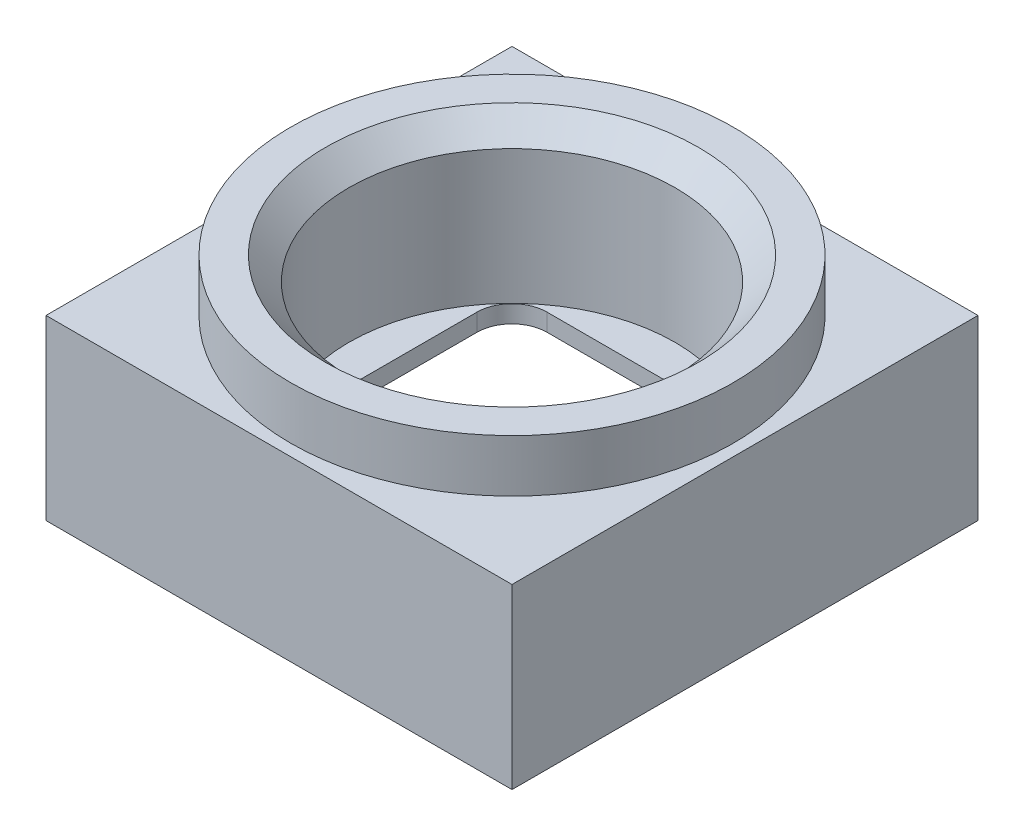
ISO-10303-21;
HEADER;
FILE_DESCRIPTION(('STEP AP214'),'2;1');
FILE_NAME('part.step','',(''),(''),'','','');
FILE_SCHEMA(('AUTOMOTIVE_DESIGN { 1 0 10303 214 1 1 1 1 }'));
ENDSEC;
DATA;
#1=APPLICATION_CONTEXT('core data for automotive mechanical design processes');
#2=APPLICATION_PROTOCOL_DEFINITION('international standard','automotive_design',2000,#1);
#3=PRODUCT_CONTEXT('',#1,'mechanical');
#4=PRODUCT('Part','Part','',(#3));
#5=PRODUCT_RELATED_PRODUCT_CATEGORY('part','',(#4));
#6=PRODUCT_DEFINITION_FORMATION('','',#4);
#7=PRODUCT_DEFINITION_CONTEXT('part definition',#1,'design');
#8=PRODUCT_DEFINITION('design','',#6,#7);
#9=PRODUCT_DEFINITION_SHAPE('','',#8);
#10=(LENGTH_UNIT() NAMED_UNIT(*) SI_UNIT(.MILLI.,.METRE.));
#11=(NAMED_UNIT(*) PLANE_ANGLE_UNIT() SI_UNIT($,.RADIAN.));
#12=(NAMED_UNIT(*) SI_UNIT($,.STERADIAN.) SOLID_ANGLE_UNIT());
#13=UNCERTAINTY_MEASURE_WITH_UNIT(LENGTH_MEASURE(1.E-05),#10,'distance_accuracy_value','');
#14=(GEOMETRIC_REPRESENTATION_CONTEXT(3) GLOBAL_UNCERTAINTY_ASSIGNED_CONTEXT((#13)) GLOBAL_UNIT_ASSIGNED_CONTEXT((#10,
#11,#12)) REPRESENTATION_CONTEXT('',''));
#15=CARTESIAN_POINT('',(0.,0.,0.));
#16=DIRECTION('',(0.,0.,1.));
#17=DIRECTION('',(1.,0.,0.));
#18=AXIS2_PLACEMENT_3D('',#15,#16,#17);
#19=CARTESIAN_POINT('',(0.,3.05,0.));
#20=DIRECTION('',(0.,1.,0.));
#21=DIRECTION('',(0.,0.,1.));
#22=AXIS2_PLACEMENT_3D('',#19,#20,#21);
#23=PLANE('',#22);
#24=DIRECTION('',(1.,0.,0.));
#25=VECTOR('',#24,1.);
#26=CARTESIAN_POINT('',(-4.00000000000003,3.05,3.99999999999998));
#27=LINE('',#26,#25);
#28=CARTESIAN_POINT('',(-4.00000000000003,3.05,3.99999999999998));
#29=VERTEX_POINT('',#28);
#30=CARTESIAN_POINT('',(3.99999999999998,3.05,3.99999999999995));
#31=VERTEX_POINT('',#30);
#32=EDGE_CURVE('E208',#29,#31,#27,.T.);
#33=ORIENTED_EDGE('',*,*,#32,.T.);
#34=DIRECTION('',(0.,0.,-1.));
#35=VECTOR('',#34,1.);
#36=CARTESIAN_POINT('',(3.99999999999998,3.05,3.99999999999995));
#37=LINE('',#36,#35);
#38=CARTESIAN_POINT('',(3.99999999999998,3.05,-4.00000000000003));
#39=VERTEX_POINT('',#38);
#40=EDGE_CURVE('E216',#31,#39,#37,.T.);
#41=ORIENTED_EDGE('',*,*,#40,.T.);
#42=DIRECTION('',(-1.,0.,0.));
#43=VECTOR('',#42,1.);
#44=CARTESIAN_POINT('',(3.99999999999998,3.05,-4.00000000000003));
#45=LINE('',#44,#43);
#46=CARTESIAN_POINT('',(-4.00000000000003,3.05,-4.00000000000003));
#47=VERTEX_POINT('',#46);
#48=EDGE_CURVE('E221',#39,#47,#45,.T.);
#49=ORIENTED_EDGE('',*,*,#48,.T.);
#50=DIRECTION('',(0.,0.,1.));
#51=VECTOR('',#50,1.);
#52=CARTESIAN_POINT('',(-4.00000000000003,3.05,-4.00000000000003));
#53=LINE('',#52,#51);
#54=EDGE_CURVE('E226',#47,#29,#53,.T.);
#55=ORIENTED_EDGE('',*,*,#54,.T.);
#56=EDGE_LOOP('',(#33,#41,#49,#55));
#57=FACE_BOUND('',#56,.T.);
#58=CARTESIAN_POINT('',(0.,3.05,0.));
#59=DIRECTION('',(0.,1.,0.));
#60=DIRECTION('',(0.,0.,1.));
#61=AXIS2_PLACEMENT_3D('',#58,#59,#60);
#62=CIRCLE('',#61,3.8);
#63=CARTESIAN_POINT('',(0.,3.05,3.8));
#64=VERTEX_POINT('',#63);
#65=EDGE_CURVE('E230',#64,#64,#62,.T.);
#66=ORIENTED_EDGE('',*,*,#65,.F.);
#67=EDGE_LOOP('',(#66));
#68=FACE_BOUND('',#67,.T.);
#69=ADVANCED_FACE('F39',(#57,#68),#23,.T.);
#70=CARTESIAN_POINT('',(0.,0.,0.));
#71=DIRECTION('',(0.,1.,0.));
#72=DIRECTION('',(0.,0.,1.));
#73=AXIS2_PLACEMENT_3D('',#70,#71,#72);
#74=PLANE('',#73);
#75=DIRECTION('',(0.,0.,1.));
#76=VECTOR('',#75,1.);
#77=CARTESIAN_POINT('',(-4.00000000000003,0.,-4.00000000000003));
#78=LINE('',#77,#76);
#79=CARTESIAN_POINT('',(-4.00000000000003,0.,-4.00000000000003));
#80=VERTEX_POINT('',#79);
#81=CARTESIAN_POINT('',(-4.00000000000003,0.,3.99999999999998));
#82=VERTEX_POINT('',#81);
#83=EDGE_CURVE('E391',#80,#82,#78,.T.);
#84=ORIENTED_EDGE('',*,*,#83,.F.);
#85=DIRECTION('',(-1.,0.,0.));
#86=VECTOR('',#85,1.);
#87=CARTESIAN_POINT('',(-4.00000000000003,0.,-4.00000000000003));
#88=LINE('',#87,#86);
#89=CARTESIAN_POINT('',(3.99999999999998,0.,-4.00000000000003));
#90=VERTEX_POINT('',#89);
#91=EDGE_CURVE('E62',#90,#80,#88,.T.);
#92=ORIENTED_EDGE('',*,*,#91,.F.);
#93=DIRECTION('',(0.,0.,-1.));
#94=VECTOR('',#93,1.);
#95=CARTESIAN_POINT('',(3.99999999999998,0.,-4.00000000000003));
#96=LINE('',#95,#94);
#97=CARTESIAN_POINT('',(3.99999999999998,0.,3.99999999999995));
#98=VERTEX_POINT('',#97);
#99=EDGE_CURVE('E395',#98,#90,#96,.T.);
#100=ORIENTED_EDGE('',*,*,#99,.F.);
#101=DIRECTION('',(1.,0.,0.));
#102=VECTOR('',#101,1.);
#103=CARTESIAN_POINT('',(-4.00000000000003,0.,3.99999999999998));
#104=LINE('',#103,#102);
#105=EDGE_CURVE('E209',#82,#98,#104,.T.);
#106=ORIENTED_EDGE('',*,*,#105,.F.);
#107=EDGE_LOOP('',(#84,#92,#100,#106));
#108=FACE_BOUND('',#107,.T.);
#109=DIRECTION('',(0.,0.,1.));
#110=VECTOR('',#109,1.);
#111=CARTESIAN_POINT('',(-3.70000000000003,0.,-3.70000000000003));
#112=LINE('',#111,#110);
#113=CARTESIAN_POINT('',(-3.70000000000003,0.,-3.70000000000003));
#114=VERTEX_POINT('',#113);
#115=CARTESIAN_POINT('',(-3.70000000000003,0.,3.69999999999998));
#116=VERTEX_POINT('',#115);
#117=EDGE_CURVE('E54',#114,#116,#112,.T.);
#118=ORIENTED_EDGE('',*,*,#117,.T.);
#119=DIRECTION('',(1.,0.,0.));
#120=VECTOR('',#119,1.);
#121=CARTESIAN_POINT('',(-3.70000000000003,0.,3.69999999999998));
#122=LINE('',#121,#120);
#123=CARTESIAN_POINT('',(3.69999999999998,0.,3.69999999999998));
#124=VERTEX_POINT('',#123);
#125=EDGE_CURVE('E376',#116,#124,#122,.T.);
#126=ORIENTED_EDGE('',*,*,#125,.T.);
#127=DIRECTION('',(0.,0.,-1.));
#128=VECTOR('',#127,1.);
#129=CARTESIAN_POINT('',(3.69999999999998,0.,-3.70000000000003));
#130=LINE('',#129,#128);
#131=CARTESIAN_POINT('',(3.69999999999998,0.,-3.70000000000003));
#132=VERTEX_POINT('',#131);
#133=EDGE_CURVE('E379',#124,#132,#130,.T.);
#134=ORIENTED_EDGE('',*,*,#133,.T.);
#135=DIRECTION('',(-1.,0.,0.));
#136=VECTOR('',#135,1.);
#137=CARTESIAN_POINT('',(-3.70000000000003,0.,-3.70000000000003));
#138=LINE('',#137,#136);
#139=EDGE_CURVE('E365',#132,#114,#138,.T.);
#140=ORIENTED_EDGE('',*,*,#139,.T.);
#141=EDGE_LOOP('',(#118,#126,#134,#140));
#142=FACE_BOUND('',#141,.T.);
#143=ADVANCED_FACE('F421',(#108,#142),#74,.F.);
#144=CARTESIAN_POINT('',(-4.00000000000003,0.6,-4.00000000000003));
#145=DIRECTION('',(1.,0.,0.));
#146=DIRECTION('',(0.,0.,-1.));
#147=AXIS2_PLACEMENT_3D('',#144,#145,#146);
#148=PLANE('',#147);
#149=ORIENTED_EDGE('',*,*,#83,.T.);
#150=DIRECTION('',(0.,-1.,0.));
#151=VECTOR('',#150,1.);
#152=CARTESIAN_POINT('',(-4.00000000000003,0.6,3.99999999999998));
#153=LINE('',#152,#151);
#154=EDGE_CURVE('E212',#29,#82,#153,.T.);
#155=ORIENTED_EDGE('',*,*,#154,.F.);
#156=ORIENTED_EDGE('',*,*,#54,.F.);
#157=DIRECTION('',(0.,-1.,0.));
#158=VECTOR('',#157,1.);
#159=CARTESIAN_POINT('',(-4.00000000000003,0.6,-4.00000000000003));
#160=LINE('',#159,#158);
#161=EDGE_CURVE('E398',#47,#80,#160,.T.);
#162=ORIENTED_EDGE('',*,*,#161,.T.);
#163=EDGE_LOOP('',(#149,#155,#156,#162));
#164=FACE_BOUND('',#163,.T.);
#165=ADVANCED_FACE('F426',(#164),#148,.F.);
#166=CARTESIAN_POINT('',(-4.00000000000003,0.6,3.99999999999998));
#167=DIRECTION('',(0.,0.,-1.));
#168=DIRECTION('',(-1.,0.,0.));
#169=AXIS2_PLACEMENT_3D('',#166,#167,#168);
#170=PLANE('',#169);
#171=ORIENTED_EDGE('',*,*,#105,.T.);
#172=DIRECTION('',(0.,-1.,0.));
#173=VECTOR('',#172,1.);
#174=CARTESIAN_POINT('',(3.99999999999998,0.6,3.99999999999995));
#175=LINE('',#174,#173);
#176=EDGE_CURVE('E203',#31,#98,#175,.T.);
#177=ORIENTED_EDGE('',*,*,#176,.F.);
#178=ORIENTED_EDGE('',*,*,#32,.F.);
#179=ORIENTED_EDGE('',*,*,#154,.T.);
#180=EDGE_LOOP('',(#171,#177,#178,#179));
#181=FACE_BOUND('',#180,.T.);
#182=ADVANCED_FACE('F205',(#181),#170,.F.);
#183=CARTESIAN_POINT('',(3.99999999999998,0.6,-4.00000000000003));
#184=DIRECTION('',(-1.,0.,0.));
#185=DIRECTION('',(0.,0.,1.));
#186=AXIS2_PLACEMENT_3D('',#183,#184,#185);
#187=PLANE('',#186);
#188=ORIENTED_EDGE('',*,*,#99,.T.);
#189=DIRECTION('',(0.,-1.,0.));
#190=VECTOR('',#189,1.);
#191=CARTESIAN_POINT('',(3.99999999999998,0.6,-4.00000000000003));
#192=LINE('',#191,#190);
#193=EDGE_CURVE('E213',#39,#90,#192,.T.);
#194=ORIENTED_EDGE('',*,*,#193,.F.);
#195=ORIENTED_EDGE('',*,*,#40,.F.);
#196=ORIENTED_EDGE('',*,*,#176,.T.);
#197=EDGE_LOOP('',(#188,#194,#195,#196));
#198=FACE_BOUND('',#197,.T.);
#199=ADVANCED_FACE('F217',(#198),#187,.F.);
#200=CARTESIAN_POINT('',(-4.00000000000003,0.6,-4.00000000000003));
#201=DIRECTION('',(0.,0.,1.));
#202=DIRECTION('',(1.,0.,0.));
#203=AXIS2_PLACEMENT_3D('',#200,#201,#202);
#204=PLANE('',#203);
#205=ORIENTED_EDGE('',*,*,#91,.T.);
#206=ORIENTED_EDGE('',*,*,#161,.F.);
#207=ORIENTED_EDGE('',*,*,#48,.F.);
#208=ORIENTED_EDGE('',*,*,#193,.T.);
#209=EDGE_LOOP('',(#205,#206,#207,#208));
#210=FACE_BOUND('',#209,.T.);
#211=ADVANCED_FACE('F521',(#210),#204,.F.);
#212=CARTESIAN_POINT('',(-3.70000000000003,0.6,-3.70000000000003));
#213=DIRECTION('',(1.,0.,0.));
#214=DIRECTION('',(0.,0.,-1.));
#215=AXIS2_PLACEMENT_3D('',#212,#213,#214);
#216=PLANE('',#215);
#217=ORIENTED_EDGE('',*,*,#117,.F.);
#218=DIRECTION('',(0.,-1.,0.));
#219=VECTOR('',#218,1.);
#220=CARTESIAN_POINT('',(-3.70000000000003,0.6,-3.70000000000003));
#221=LINE('',#220,#219);
#222=CARTESIAN_POINT('',(-3.70000000000003,0.6,-3.70000000000003));
#223=VERTEX_POINT('',#222);
#224=EDGE_CURVE('E374',#223,#114,#221,.T.);
#225=ORIENTED_EDGE('',*,*,#224,.F.);
#226=DIRECTION('',(0.,0.,1.));
#227=VECTOR('',#226,1.);
#228=CARTESIAN_POINT('',(-3.70000000000003,0.6,-3.70000000000003));
#229=LINE('',#228,#227);
#230=CARTESIAN_POINT('',(-3.70000000000003,0.6,3.69999999999998));
#231=VERTEX_POINT('',#230);
#232=EDGE_CURVE('E361',#223,#231,#229,.T.);
#233=ORIENTED_EDGE('',*,*,#232,.T.);
#234=DIRECTION('',(0.,-1.,0.));
#235=VECTOR('',#234,1.);
#236=CARTESIAN_POINT('',(-3.70000000000003,0.6,3.69999999999998));
#237=LINE('',#236,#235);
#238=EDGE_CURVE('E389',#231,#116,#237,.T.);
#239=ORIENTED_EDGE('',*,*,#238,.T.);
#240=EDGE_LOOP('',(#217,#225,#233,#239));
#241=FACE_BOUND('',#240,.T.);
#242=ADVANCED_FACE('F518',(#241),#216,.T.);
#243=CARTESIAN_POINT('',(-3.70000000000003,0.6,3.69999999999998));
#244=DIRECTION('',(0.,0.,-1.));
#245=DIRECTION('',(-1.,0.,0.));
#246=AXIS2_PLACEMENT_3D('',#243,#244,#245);
#247=PLANE('',#246);
#248=ORIENTED_EDGE('',*,*,#125,.F.);
#249=ORIENTED_EDGE('',*,*,#238,.F.);
#250=DIRECTION('',(1.,0.,0.));
#251=VECTOR('',#250,1.);
#252=CARTESIAN_POINT('',(-3.70000000000003,0.6,3.69999999999998));
#253=LINE('',#252,#251);
#254=CARTESIAN_POINT('',(3.69999999999998,0.6,3.69999999999998));
#255=VERTEX_POINT('',#254);
#256=EDGE_CURVE('E364',#231,#255,#253,.T.);
#257=ORIENTED_EDGE('',*,*,#256,.T.);
#258=DIRECTION('',(0.,-1.,0.));
#259=VECTOR('',#258,1.);
#260=CARTESIAN_POINT('',(3.69999999999998,0.6,3.69999999999998));
#261=LINE('',#260,#259);
#262=EDGE_CURVE('E387',#255,#124,#261,.T.);
#263=ORIENTED_EDGE('',*,*,#262,.T.);
#264=EDGE_LOOP('',(#248,#249,#257,#263));
#265=FACE_BOUND('',#264,.T.);
#266=ADVANCED_FACE('F514',(#265),#247,.T.);
#267=CARTESIAN_POINT('',(3.69999999999998,0.6,-3.70000000000003));
#268=DIRECTION('',(-1.,0.,0.));
#269=DIRECTION('',(0.,0.,1.));
#270=AXIS2_PLACEMENT_3D('',#267,#268,#269);
#271=PLANE('',#270);
#272=ORIENTED_EDGE('',*,*,#133,.F.);
#273=ORIENTED_EDGE('',*,*,#262,.F.);
#274=DIRECTION('',(0.,0.,-1.));
#275=VECTOR('',#274,1.);
#276=CARTESIAN_POINT('',(3.69999999999998,0.6,-3.70000000000003));
#277=LINE('',#276,#275);
#278=CARTESIAN_POINT('',(3.69999999999998,0.6,-3.70000000000003));
#279=VERTEX_POINT('',#278);
#280=EDGE_CURVE('E368',#255,#279,#277,.T.);
#281=ORIENTED_EDGE('',*,*,#280,.T.);
#282=DIRECTION('',(0.,-1.,0.));
#283=VECTOR('',#282,1.);
#284=CARTESIAN_POINT('',(3.69999999999998,0.6,-3.70000000000003));
#285=LINE('',#284,#283);
#286=EDGE_CURVE('E385',#279,#132,#285,.T.);
#287=ORIENTED_EDGE('',*,*,#286,.T.);
#288=EDGE_LOOP('',(#272,#273,#281,#287));
#289=FACE_BOUND('',#288,.T.);
#290=ADVANCED_FACE('F510',(#289),#271,.T.);
#291=CARTESIAN_POINT('',(-3.70000000000003,0.6,-3.70000000000003));
#292=DIRECTION('',(0.,0.,1.));
#293=DIRECTION('',(1.,0.,0.));
#294=AXIS2_PLACEMENT_3D('',#291,#292,#293);
#295=PLANE('',#294);
#296=ORIENTED_EDGE('',*,*,#139,.F.);
#297=ORIENTED_EDGE('',*,*,#286,.F.);
#298=DIRECTION('',(-1.,0.,0.));
#299=VECTOR('',#298,1.);
#300=CARTESIAN_POINT('',(-3.70000000000003,0.6,-3.70000000000003));
#301=LINE('',#300,#299);
#302=EDGE_CURVE('E371',#279,#223,#301,.T.);
#303=ORIENTED_EDGE('',*,*,#302,.T.);
#304=ORIENTED_EDGE('',*,*,#224,.T.);
#305=EDGE_LOOP('',(#296,#297,#303,#304));
#306=FACE_BOUND('',#305,.T.);
#307=ADVANCED_FACE('F506',(#306),#295,.T.);
#308=CARTESIAN_POINT('',(0.,0.6,0.));
#309=DIRECTION('',(0.,1.,0.));
#310=DIRECTION('',(0.,0.,1.));
#311=AXIS2_PLACEMENT_3D('',#308,#309,#310);
#312=PLANE('',#311);
#313=ORIENTED_EDGE('',*,*,#232,.F.);
#314=ORIENTED_EDGE('',*,*,#302,.F.);
#315=ORIENTED_EDGE('',*,*,#280,.F.);
#316=ORIENTED_EDGE('',*,*,#256,.F.);
#317=EDGE_LOOP('',(#313,#314,#315,#316));
#318=FACE_BOUND('',#317,.T.);
#319=CARTESIAN_POINT('',(3.1,0.6,-3.1));
#320=DIRECTION('',(0.,1.,0.));
#321=DIRECTION('',(0.,0.,1.));
#322=AXIS2_PLACEMENT_3D('',#319,#320,#321);
#323=CIRCLE('',#322,0.35);
#324=CARTESIAN_POINT('',(3.2,0.6,-2.76458980337503));
#325=VERTEX_POINT('',#324);
#326=CARTESIAN_POINT('',(2.76458980337503,0.6,-3.2));
#327=VERTEX_POINT('',#326);
#328=EDGE_CURVE('E295',#325,#327,#323,.T.);
#329=ORIENTED_EDGE('',*,*,#328,.T.);
#330=DIRECTION('',(-1.,0.,0.));
#331=VECTOR('',#330,1.);
#332=CARTESIAN_POINT('',(-2.76458980337503,0.6,-3.2));
#333=LINE('',#332,#331);
#334=CARTESIAN_POINT('',(-2.76458980337503,0.6,-3.2));
#335=VERTEX_POINT('',#334);
#336=EDGE_CURVE('E324',#327,#335,#333,.T.);
#337=ORIENTED_EDGE('',*,*,#336,.T.);
#338=CARTESIAN_POINT('',(-3.1,0.6,-3.1));
#339=DIRECTION('',(0.,1.,0.));
#340=DIRECTION('',(0.,0.,-1.));
#341=AXIS2_PLACEMENT_3D('',#338,#339,#340);
#342=CIRCLE('',#341,0.35);
#343=CARTESIAN_POINT('',(-3.2,0.6,-2.76458980337503));
#344=VERTEX_POINT('',#343);
#345=EDGE_CURVE('E327',#335,#344,#342,.T.);
#346=ORIENTED_EDGE('',*,*,#345,.T.);
#347=DIRECTION('',(0.,0.,1.));
#348=VECTOR('',#347,1.);
#349=CARTESIAN_POINT('',(-3.2,0.6,-2.76458980337503));
#350=LINE('',#349,#348);
#351=CARTESIAN_POINT('',(-3.2,0.6,2.76458980337503));
#352=VERTEX_POINT('',#351);
#353=EDGE_CURVE('E330',#344,#352,#350,.T.);
#354=ORIENTED_EDGE('',*,*,#353,.T.);
#355=CARTESIAN_POINT('',(-3.1,0.6,3.1));
#356=DIRECTION('',(0.,1.,0.));
#357=DIRECTION('',(0.,0.,1.));
#358=AXIS2_PLACEMENT_3D('',#355,#356,#357);
#359=CIRCLE('',#358,0.35);
#360=CARTESIAN_POINT('',(-2.76458980337503,0.6,3.2));
#361=VERTEX_POINT('',#360);
#362=EDGE_CURVE('E333',#352,#361,#359,.T.);
#363=ORIENTED_EDGE('',*,*,#362,.T.);
#364=DIRECTION('',(1.,0.,0.));
#365=VECTOR('',#364,1.);
#366=CARTESIAN_POINT('',(-2.76458980337503,0.6,3.2));
#367=LINE('',#366,#365);
#368=CARTESIAN_POINT('',(2.76458980337503,0.6,3.2));
#369=VERTEX_POINT('',#368);
#370=EDGE_CURVE('E336',#361,#369,#367,.T.);
#371=ORIENTED_EDGE('',*,*,#370,.T.);
#372=CARTESIAN_POINT('',(3.1,0.6,3.1));
#373=DIRECTION('',(0.,1.,0.));
#374=DIRECTION('',(0.,0.,-1.));
#375=AXIS2_PLACEMENT_3D('',#372,#373,#374);
#376=CIRCLE('',#375,0.35);
#377=CARTESIAN_POINT('',(3.2,0.6,2.76458980337503));
#378=VERTEX_POINT('',#377);
#379=EDGE_CURVE('E339',#369,#378,#376,.T.);
#380=ORIENTED_EDGE('',*,*,#379,.T.);
#381=DIRECTION('',(0.,0.,-1.));
#382=VECTOR('',#381,1.);
#383=CARTESIAN_POINT('',(3.2,0.6,-2.76458980337503));
#384=LINE('',#383,#382);
#385=EDGE_CURVE('E300',#378,#325,#384,.T.);
#386=ORIENTED_EDGE('',*,*,#385,.T.);
#387=EDGE_LOOP('',(#329,#337,#346,#354,#363,#371,#380,#386));
#388=FACE_BOUND('',#387,.T.);
#389=ADVANCED_FACE('F502',(#318,#388),#312,.F.);
#390=CARTESIAN_POINT('',(3.1,0.95,-3.1));
#391=DIRECTION('',(0.,-1.,0.));
#392=DIRECTION('',(0.,0.,-1.));
#393=AXIS2_PLACEMENT_3D('',#390,#391,#392);
#394=CYLINDRICAL_SURFACE('',#393,0.35);
#395=ORIENTED_EDGE('',*,*,#328,.F.);
#396=DIRECTION('',(0.,-1.,0.));
#397=VECTOR('',#396,1.);
#398=CARTESIAN_POINT('',(3.2,0.95,-2.76458980337503));
#399=LINE('',#398,#397);
#400=CARTESIAN_POINT('',(3.2,0.95,-2.76458980337503));
#401=VERTEX_POINT('',#400);
#402=EDGE_CURVE('E321',#401,#325,#399,.T.);
#403=ORIENTED_EDGE('',*,*,#402,.F.);
#404=CARTESIAN_POINT('',(3.1,0.95,-3.1));
#405=DIRECTION('',(0.,1.,0.));
#406=DIRECTION('',(0.,0.,1.));
#407=AXIS2_PLACEMENT_3D('',#404,#405,#406);
#408=CIRCLE('',#407,0.35);
#409=CARTESIAN_POINT('',(2.76458980337503,0.95,-3.2));
#410=VERTEX_POINT('',#409);
#411=EDGE_CURVE('E296',#401,#410,#408,.T.);
#412=ORIENTED_EDGE('',*,*,#411,.T.);
#413=DIRECTION('',(0.,-1.,0.));
#414=VECTOR('',#413,1.);
#415=CARTESIAN_POINT('',(2.76458980337503,0.95,-3.2));
#416=LINE('',#415,#414);
#417=EDGE_CURVE('E358',#410,#327,#416,.T.);
#418=ORIENTED_EDGE('',*,*,#417,.T.);
#419=EDGE_LOOP('',(#395,#403,#412,#418));
#420=FACE_BOUND('',#419,.T.);
#421=ADVANCED_FACE('F498',(#420),#394,.F.);
#422=CARTESIAN_POINT('',(-2.76458980337503,0.95,-3.2));
#423=DIRECTION('',(0.,0.,1.));
#424=DIRECTION('',(1.,0.,0.));
#425=AXIS2_PLACEMENT_3D('',#422,#423,#424);
#426=PLANE('',#425);
#427=ORIENTED_EDGE('',*,*,#336,.F.);
#428=ORIENTED_EDGE('',*,*,#417,.F.);
#429=DIRECTION('',(-1.,0.,0.));
#430=VECTOR('',#429,1.);
#431=CARTESIAN_POINT('',(-2.76458980337503,0.95,-3.2));
#432=LINE('',#431,#430);
#433=CARTESIAN_POINT('',(-2.76458980337503,0.95,-3.2));
#434=VERTEX_POINT('',#433);
#435=EDGE_CURVE('E299',#410,#434,#432,.T.);
#436=ORIENTED_EDGE('',*,*,#435,.T.);
#437=DIRECTION('',(0.,-1.,0.));
#438=VECTOR('',#437,1.);
#439=CARTESIAN_POINT('',(-2.76458980337503,0.95,-3.2));
#440=LINE('',#439,#438);
#441=EDGE_CURVE('E356',#434,#335,#440,.T.);
#442=ORIENTED_EDGE('',*,*,#441,.T.);
#443=EDGE_LOOP('',(#427,#428,#436,#442));
#444=FACE_BOUND('',#443,.T.);
#445=ADVANCED_FACE('F494',(#444),#426,.T.);
#446=CARTESIAN_POINT('',(-3.1,0.95,-3.1));
#447=DIRECTION('',(0.,-1.,0.));
#448=DIRECTION('',(0.,0.,-1.));
#449=AXIS2_PLACEMENT_3D('',#446,#447,#448);
#450=CYLINDRICAL_SURFACE('',#449,0.35);
#451=ORIENTED_EDGE('',*,*,#345,.F.);
#452=ORIENTED_EDGE('',*,*,#441,.F.);
#453=CARTESIAN_POINT('',(-3.1,0.95,-3.1));
#454=DIRECTION('',(0.,1.,0.));
#455=DIRECTION('',(0.,0.,-1.));
#456=AXIS2_PLACEMENT_3D('',#453,#454,#455);
#457=CIRCLE('',#456,0.35);
#458=CARTESIAN_POINT('',(-3.2,0.95,-2.76458980337503));
#459=VERTEX_POINT('',#458);
#460=EDGE_CURVE('E303',#434,#459,#457,.T.);
#461=ORIENTED_EDGE('',*,*,#460,.T.);
#462=DIRECTION('',(0.,-1.,0.));
#463=VECTOR('',#462,1.);
#464=CARTESIAN_POINT('',(-3.2,0.95,-2.76458980337503));
#465=LINE('',#464,#463);
#466=EDGE_CURVE('E354',#459,#344,#465,.T.);
#467=ORIENTED_EDGE('',*,*,#466,.T.);
#468=EDGE_LOOP('',(#451,#452,#461,#467));
#469=FACE_BOUND('',#468,.T.);
#470=ADVANCED_FACE('F490',(#469),#450,.F.);
#471=CARTESIAN_POINT('',(-3.2,0.95,-2.76458980337503));
#472=DIRECTION('',(1.,0.,0.));
#473=DIRECTION('',(0.,0.,-1.));
#474=AXIS2_PLACEMENT_3D('',#471,#472,#473);
#475=PLANE('',#474);
#476=ORIENTED_EDGE('',*,*,#353,.F.);
#477=ORIENTED_EDGE('',*,*,#466,.F.);
#478=DIRECTION('',(0.,0.,1.));
#479=VECTOR('',#478,1.);
#480=CARTESIAN_POINT('',(-3.2,0.95,-2.76458980337503));
#481=LINE('',#480,#479);
#482=CARTESIAN_POINT('',(-3.2,0.95,2.76458980337503));
#483=VERTEX_POINT('',#482);
#484=EDGE_CURVE('E306',#459,#483,#481,.T.);
#485=ORIENTED_EDGE('',*,*,#484,.T.);
#486=DIRECTION('',(0.,-1.,0.));
#487=VECTOR('',#486,1.);
#488=CARTESIAN_POINT('',(-3.2,0.95,2.76458980337503));
#489=LINE('',#488,#487);
#490=EDGE_CURVE('E352',#483,#352,#489,.T.);
#491=ORIENTED_EDGE('',*,*,#490,.T.);
#492=EDGE_LOOP('',(#476,#477,#485,#491));
#493=FACE_BOUND('',#492,.T.);
#494=ADVANCED_FACE('F486',(#493),#475,.T.);
#495=CARTESIAN_POINT('',(-3.1,0.95,3.1));
#496=DIRECTION('',(0.,-1.,0.));
#497=DIRECTION('',(0.,0.,-1.));
#498=AXIS2_PLACEMENT_3D('',#495,#496,#497);
#499=CYLINDRICAL_SURFACE('',#498,0.35);
#500=ORIENTED_EDGE('',*,*,#362,.F.);
#501=ORIENTED_EDGE('',*,*,#490,.F.);
#502=CARTESIAN_POINT('',(-3.1,0.95,3.1));
#503=DIRECTION('',(0.,1.,0.));
#504=DIRECTION('',(0.,0.,1.));
#505=AXIS2_PLACEMENT_3D('',#502,#503,#504);
#506=CIRCLE('',#505,0.35);
#507=CARTESIAN_POINT('',(-2.76458980337503,0.95,3.2));
#508=VERTEX_POINT('',#507);
#509=EDGE_CURVE('E309',#483,#508,#506,.T.);
#510=ORIENTED_EDGE('',*,*,#509,.T.);
#511=DIRECTION('',(0.,-1.,0.));
#512=VECTOR('',#511,1.);
#513=CARTESIAN_POINT('',(-2.76458980337503,0.95,3.2));
#514=LINE('',#513,#512);
#515=EDGE_CURVE('E350',#508,#361,#514,.T.);
#516=ORIENTED_EDGE('',*,*,#515,.T.);
#517=EDGE_LOOP('',(#500,#501,#510,#516));
#518=FACE_BOUND('',#517,.T.);
#519=ADVANCED_FACE('F482',(#518),#499,.F.);
#520=CARTESIAN_POINT('',(-2.76458980337503,0.95,3.2));
#521=DIRECTION('',(0.,0.,-1.));
#522=DIRECTION('',(-1.,0.,0.));
#523=AXIS2_PLACEMENT_3D('',#520,#521,#522);
#524=PLANE('',#523);
#525=ORIENTED_EDGE('',*,*,#370,.F.);
#526=ORIENTED_EDGE('',*,*,#515,.F.);
#527=DIRECTION('',(1.,0.,0.));
#528=VECTOR('',#527,1.);
#529=CARTESIAN_POINT('',(-2.76458980337503,0.95,3.2));
#530=LINE('',#529,#528);
#531=CARTESIAN_POINT('',(2.76458980337503,0.95,3.2));
#532=VERTEX_POINT('',#531);
#533=EDGE_CURVE('E312',#508,#532,#530,.T.);
#534=ORIENTED_EDGE('',*,*,#533,.T.);
#535=DIRECTION('',(0.,-1.,0.));
#536=VECTOR('',#535,1.);
#537=CARTESIAN_POINT('',(2.76458980337503,0.95,3.2));
#538=LINE('',#537,#536);
#539=EDGE_CURVE('E348',#532,#369,#538,.T.);
#540=ORIENTED_EDGE('',*,*,#539,.T.);
#541=EDGE_LOOP('',(#525,#526,#534,#540));
#542=FACE_BOUND('',#541,.T.);
#543=ADVANCED_FACE('F478',(#542),#524,.T.);
#544=CARTESIAN_POINT('',(3.1,0.95,3.1));
#545=DIRECTION('',(0.,-1.,0.));
#546=DIRECTION('',(0.,0.,-1.));
#547=AXIS2_PLACEMENT_3D('',#544,#545,#546);
#548=CYLINDRICAL_SURFACE('',#547,0.35);
#549=ORIENTED_EDGE('',*,*,#379,.F.);
#550=ORIENTED_EDGE('',*,*,#539,.F.);
#551=CARTESIAN_POINT('',(3.1,0.95,3.1));
#552=DIRECTION('',(0.,1.,0.));
#553=DIRECTION('',(0.,0.,-1.));
#554=AXIS2_PLACEMENT_3D('',#551,#552,#553);
#555=CIRCLE('',#554,0.35);
#556=CARTESIAN_POINT('',(3.2,0.95,2.76458980337503));
#557=VERTEX_POINT('',#556);
#558=EDGE_CURVE('E315',#532,#557,#555,.T.);
#559=ORIENTED_EDGE('',*,*,#558,.T.);
#560=DIRECTION('',(0.,-1.,0.));
#561=VECTOR('',#560,1.);
#562=CARTESIAN_POINT('',(3.2,0.95,2.76458980337503));
#563=LINE('',#562,#561);
#564=EDGE_CURVE('E346',#557,#378,#563,.T.);
#565=ORIENTED_EDGE('',*,*,#564,.T.);
#566=EDGE_LOOP('',(#549,#550,#559,#565));
#567=FACE_BOUND('',#566,.T.);
#568=ADVANCED_FACE('F474',(#567),#548,.F.);
#569=CARTESIAN_POINT('',(3.2,0.95,-2.76458980337503));
#570=DIRECTION('',(-1.,0.,0.));
#571=DIRECTION('',(0.,0.,1.));
#572=AXIS2_PLACEMENT_3D('',#569,#570,#571);
#573=PLANE('',#572);
#574=ORIENTED_EDGE('',*,*,#385,.F.);
#575=ORIENTED_EDGE('',*,*,#564,.F.);
#576=DIRECTION('',(0.,0.,-1.));
#577=VECTOR('',#576,1.);
#578=CARTESIAN_POINT('',(3.2,0.95,-2.76458980337503));
#579=LINE('',#578,#577);
#580=EDGE_CURVE('E318',#557,#401,#579,.T.);
#581=ORIENTED_EDGE('',*,*,#580,.T.);
#582=ORIENTED_EDGE('',*,*,#402,.T.);
#583=EDGE_LOOP('',(#574,#575,#581,#582));
#584=FACE_BOUND('',#583,.T.);
#585=ADVANCED_FACE('F467',(#584),#573,.T.);
#586=CARTESIAN_POINT('',(0.,1.25,0.));
#587=DIRECTION('',(0.,1.,0.));
#588=DIRECTION('',(0.,0.,1.));
#589=AXIS2_PLACEMENT_3D('',#586,#587,#588);
#590=PLANE('',#589);
#591=CARTESIAN_POINT('',(0.,1.25,0.));
#592=DIRECTION('',(0.,1.,0.));
#593=DIRECTION('',(0.,0.,1.));
#594=AXIS2_PLACEMENT_3D('',#591,#592,#593);
#595=CIRCLE('',#594,2.8);
#596=CARTESIAN_POINT('',(0.,1.25,2.8));
#597=VERTEX_POINT('',#596);
#598=EDGE_CURVE('E402',#597,#597,#595,.F.);
#599=ORIENTED_EDGE('',*,*,#598,.F.);
#600=EDGE_LOOP('',(#599));
#601=FACE_BOUND('',#600,.T.);
#602=DIRECTION('',(1.,0.,0.));
#603=VECTOR('',#602,1.);
#604=CARTESIAN_POINT('',(-1.55,1.25,2.15));
#605=LINE('',#604,#603);
#606=CARTESIAN_POINT('',(-1.55,1.25,2.15));
#607=VERTEX_POINT('',#606);
#608=CARTESIAN_POINT('',(1.55,1.25,2.15));
#609=VERTEX_POINT('',#608);
#610=EDGE_CURVE('E239',#607,#609,#605,.T.);
#611=ORIENTED_EDGE('',*,*,#610,.F.);
#612=CARTESIAN_POINT('',(-1.55,1.25,1.55));
#613=DIRECTION('',(0.,1.,0.));
#614=DIRECTION('',(0.,0.,1.));
#615=AXIS2_PLACEMENT_3D('',#612,#613,#614);
#616=CIRCLE('',#615,0.6);
#617=CARTESIAN_POINT('',(-2.15,1.25,1.55));
#618=VERTEX_POINT('',#617);
#619=EDGE_CURVE('E237',#618,#607,#616,.T.);
#620=ORIENTED_EDGE('',*,*,#619,.F.);
#621=DIRECTION('',(0.,0.,1.));
#622=VECTOR('',#621,1.);
#623=CARTESIAN_POINT('',(-2.15,1.25,-1.55));
#624=LINE('',#623,#622);
#625=CARTESIAN_POINT('',(-2.15,1.25,-1.55));
#626=VERTEX_POINT('',#625);
#627=EDGE_CURVE('E253',#626,#618,#624,.T.);
#628=ORIENTED_EDGE('',*,*,#627,.F.);
#629=CARTESIAN_POINT('',(-1.55,1.25,-1.55));
#630=DIRECTION('',(0.,1.,0.));
#631=DIRECTION('',(0.,0.,1.));
#632=AXIS2_PLACEMENT_3D('',#629,#630,#631);
#633=CIRCLE('',#632,0.6);
#634=CARTESIAN_POINT('',(-1.55,1.25,-2.15));
#635=VERTEX_POINT('',#634);
#636=EDGE_CURVE('E250',#635,#626,#633,.T.);
#637=ORIENTED_EDGE('',*,*,#636,.F.);
#638=DIRECTION('',(-1.,0.,0.));
#639=VECTOR('',#638,1.);
#640=CARTESIAN_POINT('',(-1.55,1.25,-2.15));
#641=LINE('',#640,#639);
#642=CARTESIAN_POINT('',(1.55,1.25,-2.15));
#643=VERTEX_POINT('',#642);
#644=EDGE_CURVE('E248',#643,#635,#641,.T.);
#645=ORIENTED_EDGE('',*,*,#644,.F.);
#646=CARTESIAN_POINT('',(1.55,1.25,-1.55));
#647=DIRECTION('',(0.,1.,0.));
#648=DIRECTION('',(0.,0.,-1.));
#649=AXIS2_PLACEMENT_3D('',#646,#647,#648);
#650=CIRCLE('',#649,0.6);
#651=CARTESIAN_POINT('',(2.15,1.25,-1.55));
#652=VERTEX_POINT('',#651);
#653=EDGE_CURVE('E246',#652,#643,#650,.T.);
#654=ORIENTED_EDGE('',*,*,#653,.F.);
#655=DIRECTION('',(0.,0.,-1.));
#656=VECTOR('',#655,1.);
#657=CARTESIAN_POINT('',(2.15,1.25,-1.55));
#658=LINE('',#657,#656);
#659=CARTESIAN_POINT('',(2.15,1.25,1.55));
#660=VERTEX_POINT('',#659);
#661=EDGE_CURVE('E244',#660,#652,#658,.T.);
#662=ORIENTED_EDGE('',*,*,#661,.F.);
#663=CARTESIAN_POINT('',(1.55,1.25,1.55));
#664=DIRECTION('',(0.,1.,0.));
#665=DIRECTION('',(0.,0.,1.));
#666=AXIS2_PLACEMENT_3D('',#663,#664,#665);
#667=CIRCLE('',#666,0.600000000000001);
#668=EDGE_CURVE('E242',#609,#660,#667,.T.);
#669=ORIENTED_EDGE('',*,*,#668,.F.);
#670=EDGE_LOOP('',(#611,#620,#628,#637,#645,#654,#662,#669));
#671=FACE_BOUND('',#670,.T.);
#672=ADVANCED_FACE('F464',(#601,#671),#590,.T.);
#673=CARTESIAN_POINT('',(0.,0.95,0.));
#674=DIRECTION('',(0.,1.,0.));
#675=DIRECTION('',(0.,0.,1.));
#676=AXIS2_PLACEMENT_3D('',#673,#674,#675);
#677=PLANE('',#676);
#678=ORIENTED_EDGE('',*,*,#411,.F.);
#679=ORIENTED_EDGE('',*,*,#580,.F.);
#680=ORIENTED_EDGE('',*,*,#558,.F.);
#681=ORIENTED_EDGE('',*,*,#533,.F.);
#682=ORIENTED_EDGE('',*,*,#509,.F.);
#683=ORIENTED_EDGE('',*,*,#484,.F.);
#684=ORIENTED_EDGE('',*,*,#460,.F.);
#685=ORIENTED_EDGE('',*,*,#435,.F.);
#686=EDGE_LOOP('',(#678,#679,#680,#681,#682,#683,#684,#685));
#687=FACE_BOUND('',#686,.T.);
#688=CARTESIAN_POINT('',(-1.55,0.95,1.55));
#689=DIRECTION('',(0.,1.,0.));
#690=DIRECTION('',(0.,0.,1.));
#691=AXIS2_PLACEMENT_3D('',#688,#689,#690);
#692=CIRCLE('',#691,0.6);
#693=CARTESIAN_POINT('',(-2.15,0.95,1.55));
#694=VERTEX_POINT('',#693);
#695=CARTESIAN_POINT('',(-1.55,0.95,2.15));
#696=VERTEX_POINT('',#695);
#697=EDGE_CURVE('E236',#694,#696,#692,.T.);
#698=ORIENTED_EDGE('',*,*,#697,.T.);
#699=DIRECTION('',(1.,0.,0.));
#700=VECTOR('',#699,1.);
#701=CARTESIAN_POINT('',(-1.55,0.95,2.15));
#702=LINE('',#701,#700);
#703=CARTESIAN_POINT('',(1.55,0.95,2.15));
#704=VERTEX_POINT('',#703);
#705=EDGE_CURVE('E258',#696,#704,#702,.T.);
#706=ORIENTED_EDGE('',*,*,#705,.T.);
#707=CARTESIAN_POINT('',(1.55,0.95,1.55));
#708=DIRECTION('',(0.,1.,0.));
#709=DIRECTION('',(0.,0.,1.));
#710=AXIS2_PLACEMENT_3D('',#707,#708,#709);
#711=CIRCLE('',#710,0.600000000000001);
#712=CARTESIAN_POINT('',(2.15,0.95,1.55));
#713=VERTEX_POINT('',#712);
#714=EDGE_CURVE('E261',#704,#713,#711,.T.);
#715=ORIENTED_EDGE('',*,*,#714,.T.);
#716=DIRECTION('',(0.,0.,-1.));
#717=VECTOR('',#716,1.);
#718=CARTESIAN_POINT('',(2.15,0.95,-1.55));
#719=LINE('',#718,#717);
#720=CARTESIAN_POINT('',(2.15,0.95,-1.55));
#721=VERTEX_POINT('',#720);
#722=EDGE_CURVE('E264',#713,#721,#719,.T.);
#723=ORIENTED_EDGE('',*,*,#722,.T.);
#724=CARTESIAN_POINT('',(1.55,0.95,-1.55));
#725=DIRECTION('',(0.,1.,0.));
#726=DIRECTION('',(0.,0.,-1.));
#727=AXIS2_PLACEMENT_3D('',#724,#725,#726);
#728=CIRCLE('',#727,0.6);
#729=CARTESIAN_POINT('',(1.55,0.95,-2.15));
#730=VERTEX_POINT('',#729);
#731=EDGE_CURVE('E267',#721,#730,#728,.T.);
#732=ORIENTED_EDGE('',*,*,#731,.T.);
#733=DIRECTION('',(-1.,0.,0.));
#734=VECTOR('',#733,1.);
#735=CARTESIAN_POINT('',(-1.55,0.95,-2.15));
#736=LINE('',#735,#734);
#737=CARTESIAN_POINT('',(-1.55,0.95,-2.15));
#738=VERTEX_POINT('',#737);
#739=EDGE_CURVE('E270',#730,#738,#736,.T.);
#740=ORIENTED_EDGE('',*,*,#739,.T.);
#741=CARTESIAN_POINT('',(-1.55,0.95,-1.55));
#742=DIRECTION('',(0.,1.,0.));
#743=DIRECTION('',(0.,0.,1.));
#744=AXIS2_PLACEMENT_3D('',#741,#742,#743);
#745=CIRCLE('',#744,0.6);
#746=CARTESIAN_POINT('',(-2.15,0.95,-1.55));
#747=VERTEX_POINT('',#746);
#748=EDGE_CURVE('E273',#738,#747,#745,.T.);
#749=ORIENTED_EDGE('',*,*,#748,.T.);
#750=DIRECTION('',(0.,0.,1.));
#751=VECTOR('',#750,1.);
#752=CARTESIAN_POINT('',(-2.15,0.95,-1.55));
#753=LINE('',#752,#751);
#754=EDGE_CURVE('E240',#747,#694,#753,.T.);
#755=ORIENTED_EDGE('',*,*,#754,.T.);
#756=EDGE_LOOP('',(#698,#706,#715,#723,#732,#740,#749,#755));
#757=FACE_BOUND('',#756,.T.);
#758=ADVANCED_FACE('F462',(#687,#757),#677,.F.);
#759=CARTESIAN_POINT('',(-1.55,1.25,1.55));
#760=DIRECTION('',(0.,-1.,0.));
#761=DIRECTION('',(0.,0.,-1.));
#762=AXIS2_PLACEMENT_3D('',#759,#760,#761);
#763=CYLINDRICAL_SURFACE('',#762,0.6);
#764=ORIENTED_EDGE('',*,*,#697,.F.);
#765=DIRECTION('',(0.,-1.,0.));
#766=VECTOR('',#765,1.);
#767=CARTESIAN_POINT('',(-2.15,1.25,1.55));
#768=LINE('',#767,#766);
#769=EDGE_CURVE('E255',#618,#694,#768,.T.);
#770=ORIENTED_EDGE('',*,*,#769,.F.);
#771=ORIENTED_EDGE('',*,*,#619,.T.);
#772=DIRECTION('',(0.,-1.,0.));
#773=VECTOR('',#772,1.);
#774=CARTESIAN_POINT('',(-1.55,1.25,2.15));
#775=LINE('',#774,#773);
#776=EDGE_CURVE('E292',#607,#696,#775,.T.);
#777=ORIENTED_EDGE('',*,*,#776,.T.);
#778=EDGE_LOOP('',(#764,#770,#771,#777));
#779=FACE_BOUND('',#778,.T.);
#780=ADVANCED_FACE('F458',(#779),#763,.F.);
#781=CARTESIAN_POINT('',(-1.55,1.25,2.15));
#782=DIRECTION('',(0.,0.,-1.));
#783=DIRECTION('',(-1.,0.,0.));
#784=AXIS2_PLACEMENT_3D('',#781,#782,#783);
#785=PLANE('',#784);
#786=ORIENTED_EDGE('',*,*,#705,.F.);
#787=ORIENTED_EDGE('',*,*,#776,.F.);
#788=ORIENTED_EDGE('',*,*,#610,.T.);
#789=DIRECTION('',(0.,-1.,0.));
#790=VECTOR('',#789,1.);
#791=CARTESIAN_POINT('',(1.55,1.25,2.15));
#792=LINE('',#791,#790);
#793=EDGE_CURVE('E290',#609,#704,#792,.T.);
#794=ORIENTED_EDGE('',*,*,#793,.T.);
#795=EDGE_LOOP('',(#786,#787,#788,#794));
#796=FACE_BOUND('',#795,.T.);
#797=ADVANCED_FACE('F454',(#796),#785,.T.);
#798=CARTESIAN_POINT('',(1.55,1.25,1.55));
#799=DIRECTION('',(0.,-1.,0.));
#800=DIRECTION('',(0.,0.,-1.));
#801=AXIS2_PLACEMENT_3D('',#798,#799,#800);
#802=CYLINDRICAL_SURFACE('',#801,0.600000000000001);
#803=ORIENTED_EDGE('',*,*,#714,.F.);
#804=ORIENTED_EDGE('',*,*,#793,.F.);
#805=ORIENTED_EDGE('',*,*,#668,.T.);
#806=DIRECTION('',(0.,-1.,0.));
#807=VECTOR('',#806,1.);
#808=CARTESIAN_POINT('',(2.15,1.25,1.55));
#809=LINE('',#808,#807);
#810=EDGE_CURVE('E288',#660,#713,#809,.T.);
#811=ORIENTED_EDGE('',*,*,#810,.T.);
#812=EDGE_LOOP('',(#803,#804,#805,#811));
#813=FACE_BOUND('',#812,.T.);
#814=ADVANCED_FACE('F450',(#813),#802,.F.);
#815=CARTESIAN_POINT('',(2.15,1.25,-1.55));
#816=DIRECTION('',(-1.,0.,0.));
#817=DIRECTION('',(0.,0.,1.));
#818=AXIS2_PLACEMENT_3D('',#815,#816,#817);
#819=PLANE('',#818);
#820=ORIENTED_EDGE('',*,*,#722,.F.);
#821=ORIENTED_EDGE('',*,*,#810,.F.);
#822=ORIENTED_EDGE('',*,*,#661,.T.);
#823=DIRECTION('',(0.,-1.,0.));
#824=VECTOR('',#823,1.);
#825=CARTESIAN_POINT('',(2.15,1.25,-1.55));
#826=LINE('',#825,#824);
#827=EDGE_CURVE('E286',#652,#721,#826,.T.);
#828=ORIENTED_EDGE('',*,*,#827,.T.);
#829=EDGE_LOOP('',(#820,#821,#822,#828));
#830=FACE_BOUND('',#829,.T.);
#831=ADVANCED_FACE('F446',(#830),#819,.T.);
#832=CARTESIAN_POINT('',(1.55,1.25,-1.55));
#833=DIRECTION('',(0.,-1.,0.));
#834=DIRECTION('',(0.,0.,-1.));
#835=AXIS2_PLACEMENT_3D('',#832,#833,#834);
#836=CYLINDRICAL_SURFACE('',#835,0.6);
#837=ORIENTED_EDGE('',*,*,#731,.F.);
#838=ORIENTED_EDGE('',*,*,#827,.F.);
#839=ORIENTED_EDGE('',*,*,#653,.T.);
#840=DIRECTION('',(0.,-1.,0.));
#841=VECTOR('',#840,1.);
#842=CARTESIAN_POINT('',(1.55,1.25,-2.15));
#843=LINE('',#842,#841);
#844=EDGE_CURVE('E284',#643,#730,#843,.T.);
#845=ORIENTED_EDGE('',*,*,#844,.T.);
#846=EDGE_LOOP('',(#837,#838,#839,#845));
#847=FACE_BOUND('',#846,.T.);
#848=ADVANCED_FACE('F442',(#847),#836,.F.);
#849=CARTESIAN_POINT('',(-1.55,1.25,-2.15));
#850=DIRECTION('',(0.,0.,1.));
#851=DIRECTION('',(1.,0.,0.));
#852=AXIS2_PLACEMENT_3D('',#849,#850,#851);
#853=PLANE('',#852);
#854=ORIENTED_EDGE('',*,*,#739,.F.);
#855=ORIENTED_EDGE('',*,*,#844,.F.);
#856=ORIENTED_EDGE('',*,*,#644,.T.);
#857=DIRECTION('',(0.,-1.,0.));
#858=VECTOR('',#857,1.);
#859=CARTESIAN_POINT('',(-1.55,1.25,-2.15));
#860=LINE('',#859,#858);
#861=EDGE_CURVE('E282',#635,#738,#860,.T.);
#862=ORIENTED_EDGE('',*,*,#861,.T.);
#863=EDGE_LOOP('',(#854,#855,#856,#862));
#864=FACE_BOUND('',#863,.T.);
#865=ADVANCED_FACE('F438',(#864),#853,.T.);
#866=CARTESIAN_POINT('',(-1.55,1.25,-1.55));
#867=DIRECTION('',(0.,-1.,0.));
#868=DIRECTION('',(0.,0.,-1.));
#869=AXIS2_PLACEMENT_3D('',#866,#867,#868);
#870=CYLINDRICAL_SURFACE('',#869,0.6);
#871=ORIENTED_EDGE('',*,*,#748,.F.);
#872=ORIENTED_EDGE('',*,*,#861,.F.);
#873=ORIENTED_EDGE('',*,*,#636,.T.);
#874=DIRECTION('',(0.,-1.,0.));
#875=VECTOR('',#874,1.);
#876=CARTESIAN_POINT('',(-2.15,1.25,-1.55));
#877=LINE('',#876,#875);
#878=EDGE_CURVE('E280',#626,#747,#877,.T.);
#879=ORIENTED_EDGE('',*,*,#878,.T.);
#880=EDGE_LOOP('',(#871,#872,#873,#879));
#881=FACE_BOUND('',#880,.T.);
#882=ADVANCED_FACE('F434',(#881),#870,.F.);
#883=CARTESIAN_POINT('',(-2.15,1.25,-1.55));
#884=DIRECTION('',(1.,0.,0.));
#885=DIRECTION('',(0.,0.,-1.));
#886=AXIS2_PLACEMENT_3D('',#883,#884,#885);
#887=PLANE('',#886);
#888=ORIENTED_EDGE('',*,*,#754,.F.);
#889=ORIENTED_EDGE('',*,*,#878,.F.);
#890=ORIENTED_EDGE('',*,*,#627,.T.);
#891=ORIENTED_EDGE('',*,*,#769,.T.);
#892=EDGE_LOOP('',(#888,#889,#890,#891));
#893=FACE_BOUND('',#892,.T.);
#894=ADVANCED_FACE('F431',(#893),#887,.T.);
#895=CARTESIAN_POINT('',(0.,3.05,0.));
#896=DIRECTION('',(0.,-1.,0.));
#897=DIRECTION('',(0.,0.,-1.));
#898=AXIS2_PLACEMENT_3D('',#895,#896,#897);
#899=CYLINDRICAL_SURFACE('',#898,2.8);
#900=CARTESIAN_POINT('',(0.,3.55,0.));
#901=DIRECTION('',(0.,1.,0.));
#902=DIRECTION('',(0.,0.,1.));
#903=AXIS2_PLACEMENT_3D('',#900,#901,#902);
#904=CIRCLE('',#903,2.8);
#905=CARTESIAN_POINT('',(0.,3.55,2.8));
#906=VERTEX_POINT('',#905);
#907=EDGE_CURVE('E47',#906,#906,#904,.T.);
#908=ORIENTED_EDGE('',*,*,#907,.T.);
#909=EDGE_LOOP('',(#908));
#910=FACE_BOUND('',#909,.T.);
#911=ORIENTED_EDGE('',*,*,#598,.T.);
#912=EDGE_LOOP('',(#911));
#913=FACE_BOUND('',#912,.T.);
#914=ADVANCED_FACE('F407',(#910,#913),#899,.F.);
#915=CARTESIAN_POINT('',(0.,3.95,0.));
#916=DIRECTION('',(0.,1.,0.));
#917=DIRECTION('',(0.,0.,1.));
#918=AXIS2_PLACEMENT_3D('',#915,#916,#917);
#919=PLANE('',#918);
#920=CARTESIAN_POINT('',(0.,3.95,0.));
#921=DIRECTION('',(0.,1.,0.));
#922=DIRECTION('',(0.,0.,1.));
#923=AXIS2_PLACEMENT_3D('',#920,#921,#922);
#924=CIRCLE('',#923,3.2);
#925=CARTESIAN_POINT('',(0.,3.95,3.2));
#926=VERTEX_POINT('',#925);
#927=EDGE_CURVE('E11',#926,#926,#924,.F.);
#928=ORIENTED_EDGE('',*,*,#927,.T.);
#929=EDGE_LOOP('',(#928));
#930=FACE_BOUND('',#929,.T.);
#931=CARTESIAN_POINT('',(0.,3.95,0.));
#932=DIRECTION('',(0.,1.,0.));
#933=DIRECTION('',(0.,0.,1.));
#934=AXIS2_PLACEMENT_3D('',#931,#932,#933);
#935=CIRCLE('',#934,3.8);
#936=CARTESIAN_POINT('',(0.,3.95,3.8));
#937=VERTEX_POINT('',#936);
#938=EDGE_CURVE('E227',#937,#937,#935,.T.);
#939=ORIENTED_EDGE('',*,*,#938,.T.);
#940=EDGE_LOOP('',(#939));
#941=FACE_BOUND('',#940,.T.);
#942=ADVANCED_FACE('F416',(#930,#941),#919,.T.);
#943=CARTESIAN_POINT('',(0.,3.95,0.));
#944=DIRECTION('',(0.,-1.,0.));
#945=DIRECTION('',(0.,0.,-1.));
#946=AXIS2_PLACEMENT_3D('',#943,#944,#945);
#947=CYLINDRICAL_SURFACE('',#946,3.8);
#948=ORIENTED_EDGE('',*,*,#938,.F.);
#949=EDGE_LOOP('',(#948));
#950=FACE_BOUND('',#949,.T.);
#951=ORIENTED_EDGE('',*,*,#65,.T.);
#952=EDGE_LOOP('',(#951));
#953=FACE_BOUND('',#952,.T.);
#954=ADVANCED_FACE('F411',(#950,#953),#947,.T.);
#955=CARTESIAN_POINT('',(0.,3.55,0.));
#956=DIRECTION('',(0.,1.,0.));
#957=DIRECTION('',(0.,0.,1.));
#958=AXIS2_PLACEMENT_3D('',#955,#956,#957);
#959=CONICAL_SURFACE('',#958,2.8,0.785398163397451);
#960=ORIENTED_EDGE('',*,*,#927,.F.);
#961=EDGE_LOOP('',(#960));
#962=FACE_BOUND('',#961,.T.);
#963=ORIENTED_EDGE('',*,*,#907,.F.);
#964=EDGE_LOOP('',(#963));
#965=FACE_BOUND('',#964,.T.);
#966=ADVANCED_FACE('F41',(#962,#965),#959,.F.);
#967=CLOSED_SHELL('',(#69,#143,#165,#182,#199,#211,#242,#266,#290,#307,#389,#421,#445,#470,#494,
#519,#543,#568,#585,#672,#758,#780,#797,#814,#831,#848,#865,#882,#894,#914,#942,#954,#966));
#968=MANIFOLD_SOLID_BREP('B2',#967);
#969=ADVANCED_BREP_SHAPE_REPRESENTATION('',(#18,#968),#14);
#970=SHAPE_DEFINITION_REPRESENTATION(#9,#969);
ENDSEC;
END-ISO-10303-21;
